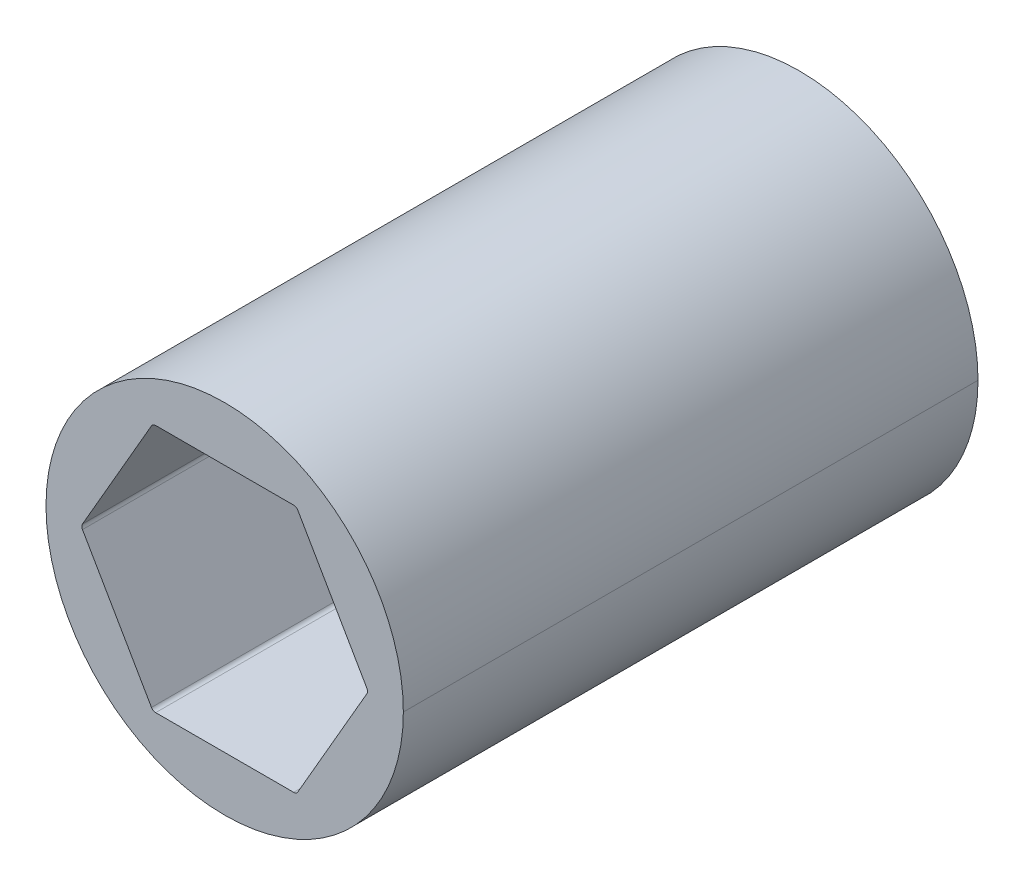
ISO-10303-21;
HEADER;
FILE_DESCRIPTION(('STEP AP214'),'2;1');
FILE_NAME('part.step','',(''),(''),'','','');
FILE_SCHEMA(('AUTOMOTIVE_DESIGN { 1 0 10303 214 1 1 1 1 }'));
ENDSEC;
DATA;
#1=APPLICATION_CONTEXT('core data for automotive mechanical design processes');
#2=APPLICATION_PROTOCOL_DEFINITION('international standard','automotive_design',2000,#1);
#3=PRODUCT_CONTEXT('',#1,'mechanical');
#4=PRODUCT('Part','Part','',(#3));
#5=PRODUCT_RELATED_PRODUCT_CATEGORY('part','',(#4));
#6=PRODUCT_DEFINITION_FORMATION('','',#4);
#7=PRODUCT_DEFINITION_CONTEXT('part definition',#1,'design');
#8=PRODUCT_DEFINITION('design','',#6,#7);
#9=PRODUCT_DEFINITION_SHAPE('','',#8);
#10=(LENGTH_UNIT() NAMED_UNIT(*) SI_UNIT(.MILLI.,.METRE.));
#11=(NAMED_UNIT(*) PLANE_ANGLE_UNIT() SI_UNIT($,.RADIAN.));
#12=(NAMED_UNIT(*) SI_UNIT($,.STERADIAN.) SOLID_ANGLE_UNIT());
#13=UNCERTAINTY_MEASURE_WITH_UNIT(LENGTH_MEASURE(1.E-05),#10,'distance_accuracy_value','');
#14=(GEOMETRIC_REPRESENTATION_CONTEXT(3) GLOBAL_UNCERTAINTY_ASSIGNED_CONTEXT((#13)) GLOBAL_UNIT_ASSIGNED_CONTEXT((#10,
#11,#12)) REPRESENTATION_CONTEXT('',''));
#15=CARTESIAN_POINT('',(0.,0.,0.));
#16=DIRECTION('',(0.,0.,1.));
#17=DIRECTION('',(1.,0.,0.));
#18=AXIS2_PLACEMENT_3D('',#15,#16,#17);
#19=CARTESIAN_POINT('',(7.25902493452117,0.,30.48));
#20=DIRECTION('',(0.,0.,1.));
#21=DIRECTION('',(1.,0.,0.));
#22=AXIS2_PLACEMENT_3D('',#19,#20,#21);
#23=CYLINDRICAL_SURFACE('',#22,0.254);
#24=CARTESIAN_POINT('',(7.25902493452117,0.,30.226));
#25=DIRECTION('',(0.,0.,1.));
#26=DIRECTION('',(1.,0.,0.));
#27=AXIS2_PLACEMENT_3D('',#24,#25,#26);
#28=CIRCLE('',#27,0.254);
#29=CARTESIAN_POINT('',(7.47899538708242,0.127,30.226));
#30=VERTEX_POINT('',#29);
#31=CARTESIAN_POINT('',(7.51302493452117,0.,30.226));
#32=VERTEX_POINT('',#31);
#33=EDGE_CURVE('E303',#30,#32,#28,.F.);
#34=ORIENTED_EDGE('',*,*,#33,.F.);
#35=DIRECTION('',(0.,0.,1.));
#36=VECTOR('',#35,1.);
#37=CARTESIAN_POINT('',(7.47899538708242,0.127,30.48));
#38=LINE('',#37,#36);
#39=CARTESIAN_POINT('',(7.47899538708242,0.127,0.));
#40=VERTEX_POINT('',#39);
#41=EDGE_CURVE('E269',#40,#30,#38,.T.);
#42=ORIENTED_EDGE('',*,*,#41,.F.);
#43=CARTESIAN_POINT('',(7.25902493452117,0.,0.));
#44=DIRECTION('',(0.,0.,1.));
#45=DIRECTION('',(1.,0.,0.));
#46=AXIS2_PLACEMENT_3D('',#43,#44,#45);
#47=CIRCLE('',#46,0.254);
#48=CARTESIAN_POINT('',(7.51302493452117,0.,0.));
#49=VERTEX_POINT('',#48);
#50=EDGE_CURVE('E201',#49,#40,#47,.T.);
#51=ORIENTED_EDGE('',*,*,#50,.F.);
#52=DIRECTION('',(0.,0.,1.));
#53=VECTOR('',#52,1.);
#54=CARTESIAN_POINT('',(7.51302493452117,0.,30.48));
#55=LINE('',#54,#53);
#56=EDGE_CURVE('E54',#49,#32,#55,.T.);
#57=ORIENTED_EDGE('',*,*,#56,.T.);
#58=EDGE_LOOP('',(#34,#42,#51,#57));
#59=FACE_BOUND('',#58,.T.);
#60=ADVANCED_FACE('F45',(#59),#23,.F.);
#61=CARTESIAN_POINT('',(0.,0.,30.48));
#62=DIRECTION('',(0.,0.,-1.));
#63=DIRECTION('',(-1.,0.,0.));
#64=AXIS2_PLACEMENT_3D('',#61,#62,#63);
#65=CYLINDRICAL_SURFACE('',#64,9.398);
#66=DIRECTION('',(0.,0.,-1.));
#67=VECTOR('',#66,1.);
#68=CARTESIAN_POINT('',(-9.398,0.,30.48));
#69=LINE('',#68,#67);
#70=CARTESIAN_POINT('',(-9.398,0.,30.226));
#71=VERTEX_POINT('',#70);
#72=CARTESIAN_POINT('',(-9.398,0.,0.));
#73=VERTEX_POINT('',#72);
#74=EDGE_CURVE('E176',#71,#73,#69,.T.);
#75=ORIENTED_EDGE('',*,*,#74,.F.);
#76=CARTESIAN_POINT('',(0.,0.,30.226));
#77=DIRECTION('',(0.,0.,1.));
#78=DIRECTION('',(1.,0.,0.));
#79=AXIS2_PLACEMENT_3D('',#76,#77,#78);
#80=CIRCLE('',#79,9.398);
#81=CARTESIAN_POINT('',(9.398,0.,30.226));
#82=VERTEX_POINT('',#81);
#83=EDGE_CURVE('E60',#82,#71,#80,.T.);
#84=ORIENTED_EDGE('',*,*,#83,.F.);
#85=DIRECTION('',(0.,0.,-1.));
#86=VECTOR('',#85,1.);
#87=CARTESIAN_POINT('',(9.398,0.,30.48));
#88=LINE('',#87,#86);
#89=CARTESIAN_POINT('',(9.398,0.,0.));
#90=VERTEX_POINT('',#89);
#91=EDGE_CURVE('E174',#82,#90,#88,.T.);
#92=ORIENTED_EDGE('',*,*,#91,.T.);
#93=CARTESIAN_POINT('',(0.,0.,0.));
#94=DIRECTION('',(0.,0.,1.));
#95=DIRECTION('',(1.,0.,0.));
#96=AXIS2_PLACEMENT_3D('',#93,#94,#95);
#97=CIRCLE('',#96,9.398);
#98=EDGE_CURVE('E183',#90,#73,#97,.T.);
#99=ORIENTED_EDGE('',*,*,#98,.T.);
#100=EDGE_LOOP('',(#75,#84,#92,#99));
#101=FACE_BOUND('',#100,.T.);
#102=ADVANCED_FACE('F172',(#101),#65,.T.);
#103=CARTESIAN_POINT('',(0.,0.,30.48));
#104=DIRECTION('',(0.,0.,-1.));
#105=DIRECTION('',(-1.,0.,0.));
#106=AXIS2_PLACEMENT_3D('',#103,#104,#105);
#107=CYLINDRICAL_SURFACE('',#106,9.398);
#108=ORIENTED_EDGE('',*,*,#91,.F.);
#109=EDGE_CURVE('E164',#71,#82,#80,.T.);
#110=ORIENTED_EDGE('',*,*,#109,.F.);
#111=ORIENTED_EDGE('',*,*,#74,.T.);
#112=CARTESIAN_POINT('',(0.,0.,0.));
#113=DIRECTION('',(0.,0.,1.));
#114=DIRECTION('',(1.,0.,0.));
#115=AXIS2_PLACEMENT_3D('',#112,#113,#114);
#116=CIRCLE('',#115,9.398);
#117=EDGE_CURVE('E181',#73,#90,#116,.T.);
#118=ORIENTED_EDGE('',*,*,#117,.T.);
#119=EDGE_LOOP('',(#108,#110,#111,#118));
#120=FACE_BOUND('',#119,.T.);
#121=ADVANCED_FACE('F179',(#120),#107,.T.);
#122=CARTESIAN_POINT('',(3.77615943563475,-6.5405,30.48));
#123=DIRECTION('',(-0.866025403784439,0.5,0.));
#124=DIRECTION('',(0.,0.,1.));
#125=AXIS2_PLACEMENT_3D('',#122,#123,#124);
#126=PLANE('',#125);
#127=DIRECTION('',(0.,0.,1.));
#128=VECTOR('',#127,1.);
#129=CARTESIAN_POINT('',(3.84948291982184,-6.4135,30.48));
#130=LINE('',#129,#128);
#131=CARTESIAN_POINT('',(3.84948291982184,-6.4135,0.));
#132=VERTEX_POINT('',#131);
#133=CARTESIAN_POINT('',(3.84948291982184,-6.4135,30.226));
#134=VERTEX_POINT('',#133);
#135=EDGE_CURVE('E220',#132,#134,#130,.T.);
#136=ORIENTED_EDGE('',*,*,#135,.T.);
#137=DIRECTION('',(0.5,0.866025403784439,0.));
#138=VECTOR('',#137,1.);
#139=CARTESIAN_POINT('',(3.77615943563475,-6.5405,30.226));
#140=LINE('',#139,#138);
#141=CARTESIAN_POINT('',(7.47899538708242,-0.127000000000001,30.226));
#142=VERTEX_POINT('',#141);
#143=EDGE_CURVE('E313',#134,#142,#140,.T.);
#144=ORIENTED_EDGE('',*,*,#143,.T.);
#145=DIRECTION('',(0.,0.,-1.));
#146=VECTOR('',#145,1.);
#147=CARTESIAN_POINT('',(7.47899538708242,-0.127,0.));
#148=LINE('',#147,#146);
#149=CARTESIAN_POINT('',(7.47899538708242,-0.127000000000001,0.));
#150=VERTEX_POINT('',#149);
#151=EDGE_CURVE('E224',#142,#150,#148,.T.);
#152=ORIENTED_EDGE('',*,*,#151,.T.);
#153=DIRECTION('',(0.5,0.866025403784439,0.));
#154=VECTOR('',#153,1.);
#155=CARTESIAN_POINT('',(3.77615943563475,-6.5405,0.));
#156=LINE('',#155,#154);
#157=EDGE_CURVE('E200',#132,#150,#156,.T.);
#158=ORIENTED_EDGE('',*,*,#157,.F.);
#159=EDGE_LOOP('',(#136,#144,#152,#158));
#160=FACE_BOUND('',#159,.T.);
#161=ADVANCED_FACE('F465',(#160),#126,.T.);
#162=CARTESIAN_POINT('',(7.5523188712695,0.,30.48));
#163=DIRECTION('',(-0.866025403784438,-0.5,0.));
#164=DIRECTION('',(-0.5,0.866025403784438,0.));
#165=AXIS2_PLACEMENT_3D('',#162,#163,#164);
#166=PLANE('',#165);
#167=ORIENTED_EDGE('',*,*,#41,.T.);
#168=DIRECTION('',(-0.5,0.866025403784438,0.));
#169=VECTOR('',#168,1.);
#170=CARTESIAN_POINT('',(7.5523188712695,0.,30.226));
#171=LINE('',#170,#169);
#172=CARTESIAN_POINT('',(3.84948291982183,6.4135,30.226));
#173=VERTEX_POINT('',#172);
#174=EDGE_CURVE('E298',#30,#173,#171,.T.);
#175=ORIENTED_EDGE('',*,*,#174,.T.);
#176=DIRECTION('',(0.,0.,-1.));
#177=VECTOR('',#176,1.);
#178=CARTESIAN_POINT('',(3.84948291982183,6.4135,0.));
#179=LINE('',#178,#177);
#180=CARTESIAN_POINT('',(3.84948291982183,6.4135,0.));
#181=VERTEX_POINT('',#180);
#182=EDGE_CURVE('E230',#173,#181,#179,.T.);
#183=ORIENTED_EDGE('',*,*,#182,.T.);
#184=DIRECTION('',(-0.5,0.866025403784438,0.));
#185=VECTOR('',#184,1.);
#186=CARTESIAN_POINT('',(7.5523188712695,0.,0.));
#187=LINE('',#186,#185);
#188=EDGE_CURVE('E228',#40,#181,#187,.T.);
#189=ORIENTED_EDGE('',*,*,#188,.F.);
#190=EDGE_LOOP('',(#167,#175,#183,#189));
#191=FACE_BOUND('',#190,.T.);
#192=ADVANCED_FACE('F297',(#191),#166,.T.);
#193=CARTESIAN_POINT('',(3.77615943563475,6.5405,30.48));
#194=DIRECTION('',(0.,-1.,0.));
#195=DIRECTION('',(0.,0.,-1.));
#196=AXIS2_PLACEMENT_3D('',#193,#194,#195);
#197=PLANE('',#196);
#198=DIRECTION('',(0.,0.,1.));
#199=VECTOR('',#198,1.);
#200=CARTESIAN_POINT('',(3.62951246726058,6.5405,30.48));
#201=LINE('',#200,#199);
#202=CARTESIAN_POINT('',(3.62951246726058,6.5405,0.));
#203=VERTEX_POINT('',#202);
#204=CARTESIAN_POINT('',(3.62951246726058,6.5405,30.226));
#205=VERTEX_POINT('',#204);
#206=EDGE_CURVE('E265',#203,#205,#201,.T.);
#207=ORIENTED_EDGE('',*,*,#206,.T.);
#208=DIRECTION('',(-1.,0.,0.));
#209=VECTOR('',#208,1.);
#210=CARTESIAN_POINT('',(3.77615943563475,6.5405,30.226));
#211=LINE('',#210,#209);
#212=CARTESIAN_POINT('',(-3.62951246726058,6.5405,30.226));
#213=VERTEX_POINT('',#212);
#214=EDGE_CURVE('E325',#205,#213,#211,.T.);
#215=ORIENTED_EDGE('',*,*,#214,.T.);
#216=DIRECTION('',(0.,0.,-1.));
#217=VECTOR('',#216,1.);
#218=CARTESIAN_POINT('',(-3.62951246726058,6.5405,0.));
#219=LINE('',#218,#217);
#220=CARTESIAN_POINT('',(-3.62951246726058,6.5405,0.));
#221=VERTEX_POINT('',#220);
#222=EDGE_CURVE('E270',#213,#221,#219,.T.);
#223=ORIENTED_EDGE('',*,*,#222,.T.);
#224=DIRECTION('',(-1.,0.,0.));
#225=VECTOR('',#224,1.);
#226=CARTESIAN_POINT('',(3.77615943563475,6.5405,0.));
#227=LINE('',#226,#225);
#228=EDGE_CURVE('E253',#203,#221,#227,.T.);
#229=ORIENTED_EDGE('',*,*,#228,.F.);
#230=EDGE_LOOP('',(#207,#215,#223,#229));
#231=FACE_BOUND('',#230,.T.);
#232=ADVANCED_FACE('F484',(#231),#197,.T.);
#233=CARTESIAN_POINT('',(-3.77615943563474,6.5405,30.48));
#234=DIRECTION('',(0.866025403784439,-0.5,0.));
#235=DIRECTION('',(0.,0.,-1.));
#236=AXIS2_PLACEMENT_3D('',#233,#234,#235);
#237=PLANE('',#236);
#238=DIRECTION('',(0.,0.,1.));
#239=VECTOR('',#238,1.);
#240=CARTESIAN_POINT('',(-3.84948291982183,6.4135,30.48));
#241=LINE('',#240,#239);
#242=CARTESIAN_POINT('',(-3.84948291982183,6.4135,0.));
#243=VERTEX_POINT('',#242);
#244=CARTESIAN_POINT('',(-3.84948291982183,6.4135,30.226));
#245=VERTEX_POINT('',#244);
#246=EDGE_CURVE('E194',#243,#245,#241,.T.);
#247=ORIENTED_EDGE('',*,*,#246,.T.);
#248=DIRECTION('',(-0.5,-0.866025403784439,0.));
#249=VECTOR('',#248,1.);
#250=CARTESIAN_POINT('',(-3.77615943563474,6.5405,30.226));
#251=LINE('',#250,#249);
#252=CARTESIAN_POINT('',(-7.47899538708242,0.127000000000006,30.226));
#253=VERTEX_POINT('',#252);
#254=EDGE_CURVE('E339',#245,#253,#251,.T.);
#255=ORIENTED_EDGE('',*,*,#254,.T.);
#256=DIRECTION('',(0.,0.,-1.));
#257=VECTOR('',#256,1.);
#258=CARTESIAN_POINT('',(-7.47899538708241,0.127000000000002,0.));
#259=LINE('',#258,#257);
#260=CARTESIAN_POINT('',(-7.47899538708241,0.127000000000003,0.));
#261=VERTEX_POINT('',#260);
#262=EDGE_CURVE('E243',#253,#261,#259,.T.);
#263=ORIENTED_EDGE('',*,*,#262,.T.);
#264=DIRECTION('',(-0.5,-0.866025403784439,0.));
#265=VECTOR('',#264,1.);
#266=CARTESIAN_POINT('',(-3.77615943563474,6.5405,0.));
#267=LINE('',#266,#265);
#268=EDGE_CURVE('E254',#243,#261,#267,.T.);
#269=ORIENTED_EDGE('',*,*,#268,.F.);
#270=EDGE_LOOP('',(#247,#255,#263,#269));
#271=FACE_BOUND('',#270,.T.);
#272=ADVANCED_FACE('F360',(#271),#237,.T.);
#273=CARTESIAN_POINT('',(-7.5523188712695,0.,30.48));
#274=DIRECTION('',(0.866025403784439,0.5,0.));
#275=DIRECTION('',(0.,0.,-1.));
#276=AXIS2_PLACEMENT_3D('',#273,#274,#275);
#277=PLANE('',#276);
#278=DIRECTION('',(0.,0.,1.));
#279=VECTOR('',#278,1.);
#280=CARTESIAN_POINT('',(-7.47899538708241,-0.126999999999998,30.48));
#281=LINE('',#280,#279);
#282=CARTESIAN_POINT('',(-7.47899538708241,-0.126999999999999,0.));
#283=VERTEX_POINT('',#282);
#284=CARTESIAN_POINT('',(-7.47899538708241,-0.126999999999998,30.226));
#285=VERTEX_POINT('',#284);
#286=EDGE_CURVE('E207',#283,#285,#281,.T.);
#287=ORIENTED_EDGE('',*,*,#286,.T.);
#288=DIRECTION('',(0.5,-0.866025403784439,0.));
#289=VECTOR('',#288,1.);
#290=CARTESIAN_POINT('',(-7.5523188712695,0.,30.226));
#291=LINE('',#290,#289);
#292=CARTESIAN_POINT('',(-3.84948291982184,-6.4135,30.226));
#293=VERTEX_POINT('',#292);
#294=EDGE_CURVE('E67',#285,#293,#291,.T.);
#295=ORIENTED_EDGE('',*,*,#294,.T.);
#296=DIRECTION('',(0.,0.,-1.));
#297=VECTOR('',#296,1.);
#298=CARTESIAN_POINT('',(-3.84948291982183,-6.4135,0.));
#299=LINE('',#298,#297);
#300=CARTESIAN_POINT('',(-3.84948291982183,-6.4135,0.));
#301=VERTEX_POINT('',#300);
#302=EDGE_CURVE('E211',#293,#301,#299,.T.);
#303=ORIENTED_EDGE('',*,*,#302,.T.);
#304=DIRECTION('',(0.5,-0.866025403784439,0.));
#305=VECTOR('',#304,1.);
#306=CARTESIAN_POINT('',(-7.5523188712695,0.,0.));
#307=LINE('',#306,#305);
#308=EDGE_CURVE('E219',#283,#301,#307,.T.);
#309=ORIENTED_EDGE('',*,*,#308,.F.);
#310=EDGE_LOOP('',(#287,#295,#303,#309));
#311=FACE_BOUND('',#310,.T.);
#312=ADVANCED_FACE('F346',(#311),#277,.T.);
#313=CARTESIAN_POINT('',(-3.77615943563474,-6.5405,30.48));
#314=DIRECTION('',(0.,1.,0.));
#315=DIRECTION('',(1.,0.,0.));
#316=AXIS2_PLACEMENT_3D('',#313,#314,#315);
#317=PLANE('',#316);
#318=DIRECTION('',(0.,0.,1.));
#319=VECTOR('',#318,1.);
#320=CARTESIAN_POINT('',(-3.62951246726058,-6.5405,30.48));
#321=LINE('',#320,#319);
#322=CARTESIAN_POINT('',(-3.62951246726058,-6.5405,0.));
#323=VERTEX_POINT('',#322);
#324=CARTESIAN_POINT('',(-3.62951246726058,-6.5405,30.226));
#325=VERTEX_POINT('',#324);
#326=EDGE_CURVE('E205',#323,#325,#321,.T.);
#327=ORIENTED_EDGE('',*,*,#326,.T.);
#328=DIRECTION('',(1.,0.,0.));
#329=VECTOR('',#328,1.);
#330=CARTESIAN_POINT('',(-3.77615943563474,-6.5405,30.226));
#331=LINE('',#330,#329);
#332=CARTESIAN_POINT('',(3.62951246726059,-6.5405,30.226));
#333=VERTEX_POINT('',#332);
#334=EDGE_CURVE('E329',#325,#333,#331,.T.);
#335=ORIENTED_EDGE('',*,*,#334,.T.);
#336=DIRECTION('',(0.,0.,-1.));
#337=VECTOR('',#336,1.);
#338=CARTESIAN_POINT('',(3.62951246726059,-6.5405,0.));
#339=LINE('',#338,#337);
#340=CARTESIAN_POINT('',(3.62951246726058,-6.5405,0.));
#341=VERTEX_POINT('',#340);
#342=EDGE_CURVE('E202',#333,#341,#339,.T.);
#343=ORIENTED_EDGE('',*,*,#342,.T.);
#344=DIRECTION('',(1.,0.,0.));
#345=VECTOR('',#344,1.);
#346=CARTESIAN_POINT('',(-3.77615943563474,-6.5405,0.));
#347=LINE('',#346,#345);
#348=EDGE_CURVE('E190',#323,#341,#347,.T.);
#349=ORIENTED_EDGE('',*,*,#348,.F.);
#350=EDGE_LOOP('',(#327,#335,#343,#349));
#351=FACE_BOUND('',#350,.T.);
#352=ADVANCED_FACE('F510',(#351),#317,.T.);
#353=CARTESIAN_POINT('',(3.62951246726058,6.2865,30.48));
#354=DIRECTION('',(0.,0.,1.));
#355=DIRECTION('',(1.,0.,0.));
#356=AXIS2_PLACEMENT_3D('',#353,#354,#355);
#357=CYLINDRICAL_SURFACE('',#356,0.254);
#358=CARTESIAN_POINT('',(3.62951246726058,6.2865,30.226));
#359=DIRECTION('',(0.,0.,1.));
#360=DIRECTION('',(1.,0.,0.));
#361=AXIS2_PLACEMENT_3D('',#358,#359,#360);
#362=CIRCLE('',#361,0.254);
#363=EDGE_CURVE('E319',#205,#173,#362,.F.);
#364=ORIENTED_EDGE('',*,*,#363,.F.);
#365=ORIENTED_EDGE('',*,*,#206,.F.);
#366=CARTESIAN_POINT('',(3.62951246726058,6.2865,0.));
#367=DIRECTION('',(0.,0.,1.));
#368=DIRECTION('',(1.,0.,0.));
#369=AXIS2_PLACEMENT_3D('',#366,#367,#368);
#370=CIRCLE('',#369,0.254);
#371=EDGE_CURVE('E258',#181,#203,#370,.T.);
#372=ORIENTED_EDGE('',*,*,#371,.F.);
#373=ORIENTED_EDGE('',*,*,#182,.F.);
#374=EDGE_LOOP('',(#364,#365,#372,#373));
#375=FACE_BOUND('',#374,.T.);
#376=ADVANCED_FACE('F519',(#375),#357,.F.);
#377=CARTESIAN_POINT('',(-3.62951246726058,6.2865,30.48));
#378=DIRECTION('',(0.,0.,1.));
#379=DIRECTION('',(1.,0.,0.));
#380=AXIS2_PLACEMENT_3D('',#377,#378,#379);
#381=CYLINDRICAL_SURFACE('',#380,0.254);
#382=CARTESIAN_POINT('',(-3.62951246726058,6.2865,30.226));
#383=DIRECTION('',(0.,0.,1.));
#384=DIRECTION('',(1.,0.,0.));
#385=AXIS2_PLACEMENT_3D('',#382,#383,#384);
#386=CIRCLE('',#385,0.254);
#387=EDGE_CURVE('E333',#245,#213,#386,.F.);
#388=ORIENTED_EDGE('',*,*,#387,.F.);
#389=ORIENTED_EDGE('',*,*,#246,.F.);
#390=CARTESIAN_POINT('',(-3.62951246726058,6.2865,0.));
#391=DIRECTION('',(0.,0.,1.));
#392=DIRECTION('',(1.,0.,0.));
#393=AXIS2_PLACEMENT_3D('',#390,#391,#392);
#394=CIRCLE('',#393,0.254);
#395=EDGE_CURVE('E249',#221,#243,#394,.T.);
#396=ORIENTED_EDGE('',*,*,#395,.F.);
#397=ORIENTED_EDGE('',*,*,#222,.F.);
#398=EDGE_LOOP('',(#388,#389,#396,#397));
#399=FACE_BOUND('',#398,.T.);
#400=ADVANCED_FACE('F528',(#399),#381,.F.);
#401=CARTESIAN_POINT('',(-3.62951246726058,-6.2865,30.48));
#402=DIRECTION('',(0.,0.,1.));
#403=DIRECTION('',(1.,0.,0.));
#404=AXIS2_PLACEMENT_3D('',#401,#402,#403);
#405=CYLINDRICAL_SURFACE('',#404,0.254);
#406=CARTESIAN_POINT('',(-3.62951246726058,-6.2865,30.226));
#407=DIRECTION('',(0.,0.,1.));
#408=DIRECTION('',(1.,0.,0.));
#409=AXIS2_PLACEMENT_3D('',#406,#407,#408);
#410=CIRCLE('',#409,0.254);
#411=EDGE_CURVE('E336',#325,#293,#410,.F.);
#412=ORIENTED_EDGE('',*,*,#411,.F.);
#413=ORIENTED_EDGE('',*,*,#326,.F.);
#414=CARTESIAN_POINT('',(-3.62951246726058,-6.2865,0.));
#415=DIRECTION('',(0.,0.,1.));
#416=DIRECTION('',(1.,0.,0.));
#417=AXIS2_PLACEMENT_3D('',#414,#415,#416);
#418=CIRCLE('',#417,0.254);
#419=EDGE_CURVE('E216',#301,#323,#418,.T.);
#420=ORIENTED_EDGE('',*,*,#419,.F.);
#421=ORIENTED_EDGE('',*,*,#302,.F.);
#422=EDGE_LOOP('',(#412,#413,#420,#421));
#423=FACE_BOUND('',#422,.T.);
#424=ADVANCED_FACE('F351',(#423),#405,.F.);
#425=CARTESIAN_POINT('',(3.62951246726059,-6.2865,30.48));
#426=DIRECTION('',(0.,0.,1.));
#427=DIRECTION('',(1.,0.,0.));
#428=AXIS2_PLACEMENT_3D('',#425,#426,#427);
#429=CYLINDRICAL_SURFACE('',#428,0.254);
#430=CARTESIAN_POINT('',(3.62951246726059,-6.2865,30.226));
#431=DIRECTION('',(0.,0.,1.));
#432=DIRECTION('',(1.,0.,0.));
#433=AXIS2_PLACEMENT_3D('',#430,#431,#432);
#434=CIRCLE('',#433,0.254);
#435=EDGE_CURVE('E322',#134,#333,#434,.F.);
#436=ORIENTED_EDGE('',*,*,#435,.F.);
#437=ORIENTED_EDGE('',*,*,#135,.F.);
#438=CARTESIAN_POINT('',(3.62951246726059,-6.2865,0.));
#439=DIRECTION('',(0.,0.,1.));
#440=DIRECTION('',(1.,0.,0.));
#441=AXIS2_PLACEMENT_3D('',#438,#439,#440);
#442=CIRCLE('',#441,0.254);
#443=EDGE_CURVE('E212',#341,#132,#442,.T.);
#444=ORIENTED_EDGE('',*,*,#443,.F.);
#445=ORIENTED_EDGE('',*,*,#342,.F.);
#446=EDGE_LOOP('',(#436,#437,#444,#445));
#447=FACE_BOUND('',#446,.T.);
#448=ADVANCED_FACE('F394',(#447),#429,.F.);
#449=CARTESIAN_POINT('',(7.25902493452117,0.,30.48));
#450=DIRECTION('',(0.,0.,1.));
#451=DIRECTION('',(1.,0.,0.));
#452=AXIS2_PLACEMENT_3D('',#449,#450,#451);
#453=CYLINDRICAL_SURFACE('',#452,0.254);
#454=CARTESIAN_POINT('',(7.25902493452117,0.,30.226));
#455=DIRECTION('',(0.,0.,1.));
#456=DIRECTION('',(1.,0.,0.));
#457=AXIS2_PLACEMENT_3D('',#454,#455,#456);
#458=CIRCLE('',#457,0.254);
#459=EDGE_CURVE('E206',#32,#142,#458,.F.);
#460=ORIENTED_EDGE('',*,*,#459,.F.);
#461=ORIENTED_EDGE('',*,*,#56,.F.);
#462=CARTESIAN_POINT('',(7.25902493452117,0.,0.));
#463=DIRECTION('',(0.,0.,1.));
#464=DIRECTION('',(1.,0.,0.));
#465=AXIS2_PLACEMENT_3D('',#462,#463,#464);
#466=CIRCLE('',#465,0.254);
#467=EDGE_CURVE('E196',#150,#49,#466,.T.);
#468=ORIENTED_EDGE('',*,*,#467,.F.);
#469=ORIENTED_EDGE('',*,*,#151,.F.);
#470=EDGE_LOOP('',(#460,#461,#468,#469));
#471=FACE_BOUND('',#470,.T.);
#472=ADVANCED_FACE('F309',(#471),#453,.F.);
#473=CARTESIAN_POINT('',(-7.25902493452117,0.,30.48));
#474=DIRECTION('',(0.,0.,1.));
#475=DIRECTION('',(1.,0.,0.));
#476=AXIS2_PLACEMENT_3D('',#473,#474,#475);
#477=CYLINDRICAL_SURFACE('',#476,0.254);
#478=CARTESIAN_POINT('',(-7.25902493452117,0.,30.226));
#479=DIRECTION('',(0.,0.,1.));
#480=DIRECTION('',(1.,0.,0.));
#481=AXIS2_PLACEMENT_3D('',#478,#479,#480);
#482=CIRCLE('',#481,0.254);
#483=EDGE_CURVE('E11',#285,#253,#482,.F.);
#484=ORIENTED_EDGE('',*,*,#483,.F.);
#485=ORIENTED_EDGE('',*,*,#286,.F.);
#486=CARTESIAN_POINT('',(-7.25902493452117,0.,0.));
#487=DIRECTION('',(0.,0.,1.));
#488=DIRECTION('',(1.,0.,0.));
#489=AXIS2_PLACEMENT_3D('',#486,#487,#488);
#490=CIRCLE('',#489,0.254);
#491=EDGE_CURVE('E240',#261,#283,#490,.T.);
#492=ORIENTED_EDGE('',*,*,#491,.F.);
#493=ORIENTED_EDGE('',*,*,#262,.F.);
#494=EDGE_LOOP('',(#484,#485,#492,#493));
#495=FACE_BOUND('',#494,.T.);
#496=ADVANCED_FACE('F47',(#495),#477,.F.);
#497=CARTESIAN_POINT('',(0.,0.,0.));
#498=DIRECTION('',(0.,0.,1.));
#499=DIRECTION('',(1.,0.,0.));
#500=AXIS2_PLACEMENT_3D('',#497,#498,#499);
#501=PLANE('',#500);
#502=ORIENTED_EDGE('',*,*,#117,.F.);
#503=ORIENTED_EDGE('',*,*,#98,.F.);
#504=EDGE_LOOP('',(#502,#503));
#505=FACE_BOUND('',#504,.T.);
#506=ORIENTED_EDGE('',*,*,#348,.T.);
#507=ORIENTED_EDGE('',*,*,#443,.T.);
#508=ORIENTED_EDGE('',*,*,#157,.T.);
#509=ORIENTED_EDGE('',*,*,#467,.T.);
#510=ORIENTED_EDGE('',*,*,#50,.T.);
#511=ORIENTED_EDGE('',*,*,#188,.T.);
#512=ORIENTED_EDGE('',*,*,#371,.T.);
#513=ORIENTED_EDGE('',*,*,#228,.T.);
#514=ORIENTED_EDGE('',*,*,#395,.T.);
#515=ORIENTED_EDGE('',*,*,#268,.T.);
#516=ORIENTED_EDGE('',*,*,#491,.T.);
#517=ORIENTED_EDGE('',*,*,#308,.T.);
#518=ORIENTED_EDGE('',*,*,#419,.T.);
#519=EDGE_LOOP('',(#506,#507,#508,#509,#510,#511,#512,#513,#514,#515,#516,#517,#518));
#520=FACE_BOUND('',#519,.T.);
#521=ADVANCED_FACE('F304',(#505,#520),#501,.F.);
#522=CARTESIAN_POINT('',(0.,0.,30.226));
#523=DIRECTION('',(0.,0.,1.));
#524=DIRECTION('',(1.,0.,0.));
#525=AXIS2_PLACEMENT_3D('',#522,#523,#524);
#526=PLANE('',#525);
#527=ORIENTED_EDGE('',*,*,#83,.T.);
#528=ORIENTED_EDGE('',*,*,#109,.T.);
#529=EDGE_LOOP('',(#527,#528));
#530=FACE_BOUND('',#529,.T.);
#531=ORIENTED_EDGE('',*,*,#459,.T.);
#532=ORIENTED_EDGE('',*,*,#143,.F.);
#533=ORIENTED_EDGE('',*,*,#435,.T.);
#534=ORIENTED_EDGE('',*,*,#334,.F.);
#535=ORIENTED_EDGE('',*,*,#411,.T.);
#536=ORIENTED_EDGE('',*,*,#294,.F.);
#537=ORIENTED_EDGE('',*,*,#483,.T.);
#538=ORIENTED_EDGE('',*,*,#254,.F.);
#539=ORIENTED_EDGE('',*,*,#387,.T.);
#540=ORIENTED_EDGE('',*,*,#214,.F.);
#541=ORIENTED_EDGE('',*,*,#363,.T.);
#542=ORIENTED_EDGE('',*,*,#174,.F.);
#543=ORIENTED_EDGE('',*,*,#33,.T.);
#544=EDGE_LOOP('',(#531,#532,#533,#534,#535,#536,#537,#538,#539,#540,#541,#542,#543));
#545=FACE_BOUND('',#544,.T.);
#546=ADVANCED_FACE('F165',(#530,#545),#526,.T.);
#547=CLOSED_SHELL('',(#60,#102,#121,#161,#192,#232,#272,#312,#352,#376,#400,#424,#448,#472,#496,
#521,#546));
#548=MANIFOLD_SOLID_BREP('B2',#547);
#549=ADVANCED_BREP_SHAPE_REPRESENTATION('',(#18,#548),#14);
#550=SHAPE_DEFINITION_REPRESENTATION(#9,#549);
ENDSEC;
END-ISO-10303-21;
